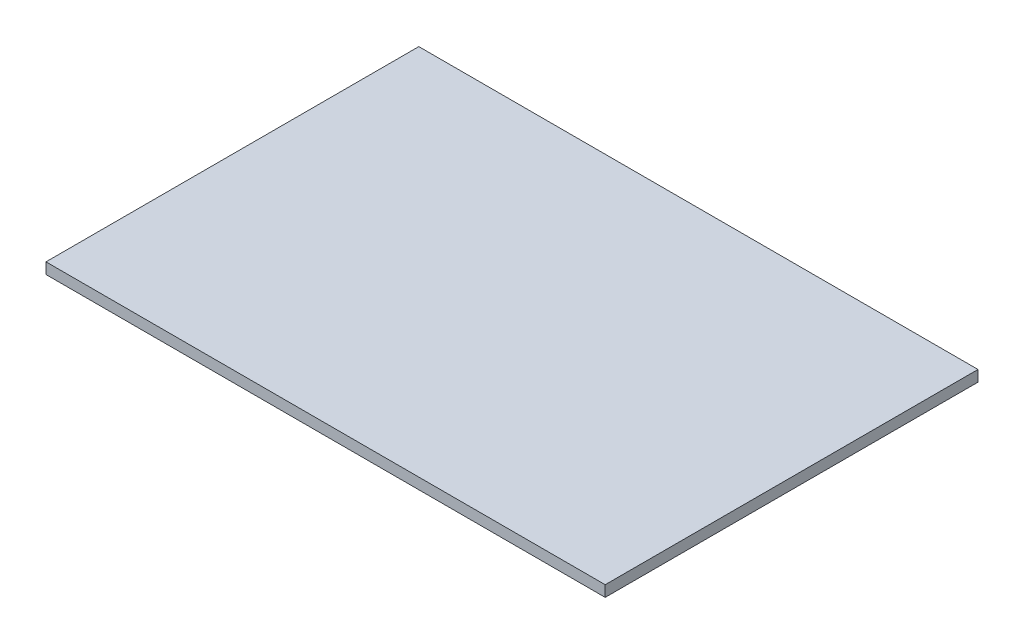
ISO-10303-21;
HEADER;
FILE_DESCRIPTION(('STEP AP214'),'2;1');
FILE_NAME('part.step','',(''),(''),'','','');
FILE_SCHEMA(('AUTOMOTIVE_DESIGN { 1 0 10303 214 1 1 1 1 }'));
ENDSEC;
DATA;
#1=APPLICATION_CONTEXT('core data for automotive mechanical design processes');
#2=APPLICATION_PROTOCOL_DEFINITION('international standard','automotive_design',2000,#1);
#3=PRODUCT_CONTEXT('',#1,'mechanical');
#4=PRODUCT('Part','Part','',(#3));
#5=PRODUCT_RELATED_PRODUCT_CATEGORY('part','',(#4));
#6=PRODUCT_DEFINITION_FORMATION('','',#4);
#7=PRODUCT_DEFINITION_CONTEXT('part definition',#1,'design');
#8=PRODUCT_DEFINITION('design','',#6,#7);
#9=PRODUCT_DEFINITION_SHAPE('','',#8);
#10=(LENGTH_UNIT() NAMED_UNIT(*) SI_UNIT(.MILLI.,.METRE.));
#11=(NAMED_UNIT(*) PLANE_ANGLE_UNIT() SI_UNIT($,.RADIAN.));
#12=(NAMED_UNIT(*) SI_UNIT($,.STERADIAN.) SOLID_ANGLE_UNIT());
#13=UNCERTAINTY_MEASURE_WITH_UNIT(LENGTH_MEASURE(1.E-05),#10,'distance_accuracy_value','');
#14=(GEOMETRIC_REPRESENTATION_CONTEXT(3) GLOBAL_UNCERTAINTY_ASSIGNED_CONTEXT((#13)) GLOBAL_UNIT_ASSIGNED_CONTEXT((#10,
#11,#12)) REPRESENTATION_CONTEXT('',''));
#15=CARTESIAN_POINT('',(0.,0.,0.));
#16=DIRECTION('',(0.,0.,1.));
#17=DIRECTION('',(1.,0.,0.));
#18=AXIS2_PLACEMENT_3D('',#15,#16,#17);
#19=CARTESIAN_POINT('',(-152.4,6.,101.6));
#20=DIRECTION('',(1.,0.,0.));
#21=DIRECTION('',(0.,0.,-1.));
#22=AXIS2_PLACEMENT_3D('',#19,#20,#21);
#23=PLANE('',#22);
#24=DIRECTION('',(0.,0.,1.));
#25=VECTOR('',#24,1.);
#26=CARTESIAN_POINT('',(-152.4,0.,101.6));
#27=LINE('',#26,#25);
#28=CARTESIAN_POINT('',(-152.4,0.,-101.6));
#29=VERTEX_POINT('',#28);
#30=CARTESIAN_POINT('',(-152.4,0.,101.6));
#31=VERTEX_POINT('',#30);
#32=EDGE_CURVE('E97',#29,#31,#27,.T.);
#33=ORIENTED_EDGE('',*,*,#32,.T.);
#34=DIRECTION('',(0.,-1.,0.));
#35=VECTOR('',#34,1.);
#36=CARTESIAN_POINT('',(-152.4,6.,101.6));
#37=LINE('',#36,#35);
#38=CARTESIAN_POINT('',(-152.4,6.,101.6));
#39=VERTEX_POINT('',#38);
#40=EDGE_CURVE('E11',#39,#31,#37,.T.);
#41=ORIENTED_EDGE('',*,*,#40,.F.);
#42=DIRECTION('',(0.,0.,1.));
#43=VECTOR('',#42,1.);
#44=CARTESIAN_POINT('',(-152.4,6.,101.6));
#45=LINE('',#44,#43);
#46=CARTESIAN_POINT('',(-152.4,6.,-101.6));
#47=VERTEX_POINT('',#46);
#48=EDGE_CURVE('E85',#47,#39,#45,.T.);
#49=ORIENTED_EDGE('',*,*,#48,.F.);
#50=DIRECTION('',(0.,-1.,0.));
#51=VECTOR('',#50,1.);
#52=CARTESIAN_POINT('',(-152.4,6.,-101.6));
#53=LINE('',#52,#51);
#54=EDGE_CURVE('E93',#47,#29,#53,.T.);
#55=ORIENTED_EDGE('',*,*,#54,.T.);
#56=EDGE_LOOP('',(#33,#41,#49,#55));
#57=FACE_BOUND('',#56,.T.);
#58=ADVANCED_FACE('F34',(#57),#23,.F.);
#59=CARTESIAN_POINT('',(152.4,6.,101.6));
#60=DIRECTION('',(0.,0.,-1.));
#61=DIRECTION('',(-1.,0.,0.));
#62=AXIS2_PLACEMENT_3D('',#59,#60,#61);
#63=PLANE('',#62);
#64=DIRECTION('',(1.,0.,0.));
#65=VECTOR('',#64,1.);
#66=CARTESIAN_POINT('',(152.4,0.,101.6));
#67=LINE('',#66,#65);
#68=CARTESIAN_POINT('',(152.4,0.,101.6));
#69=VERTEX_POINT('',#68);
#70=EDGE_CURVE('E89',#31,#69,#67,.T.);
#71=ORIENTED_EDGE('',*,*,#70,.T.);
#72=DIRECTION('',(0.,-1.,0.));
#73=VECTOR('',#72,1.);
#74=CARTESIAN_POINT('',(152.4,6.,101.6));
#75=LINE('',#74,#73);
#76=CARTESIAN_POINT('',(152.4,6.,101.6));
#77=VERTEX_POINT('',#76);
#78=EDGE_CURVE('E42',#77,#69,#75,.T.);
#79=ORIENTED_EDGE('',*,*,#78,.F.);
#80=DIRECTION('',(1.,0.,0.));
#81=VECTOR('',#80,1.);
#82=CARTESIAN_POINT('',(152.4,6.,101.6));
#83=LINE('',#82,#81);
#84=EDGE_CURVE('E80',#39,#77,#83,.T.);
#85=ORIENTED_EDGE('',*,*,#84,.F.);
#86=ORIENTED_EDGE('',*,*,#40,.T.);
#87=EDGE_LOOP('',(#71,#79,#85,#86));
#88=FACE_BOUND('',#87,.T.);
#89=ADVANCED_FACE('F88',(#88),#63,.F.);
#90=CARTESIAN_POINT('',(152.4,6.,101.6));
#91=DIRECTION('',(-1.,0.,0.));
#92=DIRECTION('',(0.,0.,1.));
#93=AXIS2_PLACEMENT_3D('',#90,#91,#92);
#94=PLANE('',#93);
#95=DIRECTION('',(0.,0.,-1.));
#96=VECTOR('',#95,1.);
#97=CARTESIAN_POINT('',(152.4,0.,101.6));
#98=LINE('',#97,#96);
#99=CARTESIAN_POINT('',(152.4,0.,-101.6));
#100=VERTEX_POINT('',#99);
#101=EDGE_CURVE('E67',#69,#100,#98,.T.);
#102=ORIENTED_EDGE('',*,*,#101,.T.);
#103=DIRECTION('',(0.,-1.,0.));
#104=VECTOR('',#103,1.);
#105=CARTESIAN_POINT('',(152.4,6.,-101.6));
#106=LINE('',#105,#104);
#107=CARTESIAN_POINT('',(152.4,6.,-101.6));
#108=VERTEX_POINT('',#107);
#109=EDGE_CURVE('E90',#108,#100,#106,.T.);
#110=ORIENTED_EDGE('',*,*,#109,.F.);
#111=DIRECTION('',(0.,0.,-1.));
#112=VECTOR('',#111,1.);
#113=CARTESIAN_POINT('',(152.4,6.,101.6));
#114=LINE('',#113,#112);
#115=EDGE_CURVE('E83',#77,#108,#114,.T.);
#116=ORIENTED_EDGE('',*,*,#115,.F.);
#117=ORIENTED_EDGE('',*,*,#78,.T.);
#118=EDGE_LOOP('',(#102,#110,#116,#117));
#119=FACE_BOUND('',#118,.T.);
#120=ADVANCED_FACE('F91',(#119),#94,.F.);
#121=CARTESIAN_POINT('',(152.4,6.,-101.6));
#122=DIRECTION('',(0.,0.,1.));
#123=DIRECTION('',(1.,0.,0.));
#124=AXIS2_PLACEMENT_3D('',#121,#122,#123);
#125=PLANE('',#124);
#126=DIRECTION('',(-1.,0.,0.));
#127=VECTOR('',#126,1.);
#128=CARTESIAN_POINT('',(152.4,0.,-101.6));
#129=LINE('',#128,#127);
#130=EDGE_CURVE('E73',#100,#29,#129,.T.);
#131=ORIENTED_EDGE('',*,*,#130,.T.);
#132=ORIENTED_EDGE('',*,*,#54,.F.);
#133=DIRECTION('',(-1.,0.,0.));
#134=VECTOR('',#133,1.);
#135=CARTESIAN_POINT('',(152.4,6.,-101.6));
#136=LINE('',#135,#134);
#137=EDGE_CURVE('E50',#108,#47,#136,.T.);
#138=ORIENTED_EDGE('',*,*,#137,.F.);
#139=ORIENTED_EDGE('',*,*,#109,.T.);
#140=EDGE_LOOP('',(#131,#132,#138,#139));
#141=FACE_BOUND('',#140,.T.);
#142=ADVANCED_FACE('F104',(#141),#125,.F.);
#143=CARTESIAN_POINT('',(0.,6.,0.));
#144=DIRECTION('',(0.,1.,0.));
#145=DIRECTION('',(0.,0.,1.));
#146=AXIS2_PLACEMENT_3D('',#143,#144,#145);
#147=PLANE('',#146);
#148=ORIENTED_EDGE('',*,*,#48,.T.);
#149=ORIENTED_EDGE('',*,*,#84,.T.);
#150=ORIENTED_EDGE('',*,*,#115,.T.);
#151=ORIENTED_EDGE('',*,*,#137,.T.);
#152=EDGE_LOOP('',(#148,#149,#150,#151));
#153=FACE_BOUND('',#152,.T.);
#154=ADVANCED_FACE('F81',(#153),#147,.T.);
#155=CARTESIAN_POINT('',(0.,0.,0.));
#156=DIRECTION('',(0.,1.,0.));
#157=DIRECTION('',(0.,0.,1.));
#158=AXIS2_PLACEMENT_3D('',#155,#156,#157);
#159=PLANE('',#158);
#160=ORIENTED_EDGE('',*,*,#32,.F.);
#161=ORIENTED_EDGE('',*,*,#130,.F.);
#162=ORIENTED_EDGE('',*,*,#101,.F.);
#163=ORIENTED_EDGE('',*,*,#70,.F.);
#164=EDGE_LOOP('',(#160,#161,#162,#163));
#165=FACE_BOUND('',#164,.T.);
#166=ADVANCED_FACE('F107',(#165),#159,.F.);
#167=CLOSED_SHELL('',(#58,#89,#120,#142,#154,#166));
#168=MANIFOLD_SOLID_BREP('B2',#167);
#169=ADVANCED_BREP_SHAPE_REPRESENTATION('',(#18,#168),#14);
#170=SHAPE_DEFINITION_REPRESENTATION(#9,#169);
ENDSEC;
END-ISO-10303-21;
